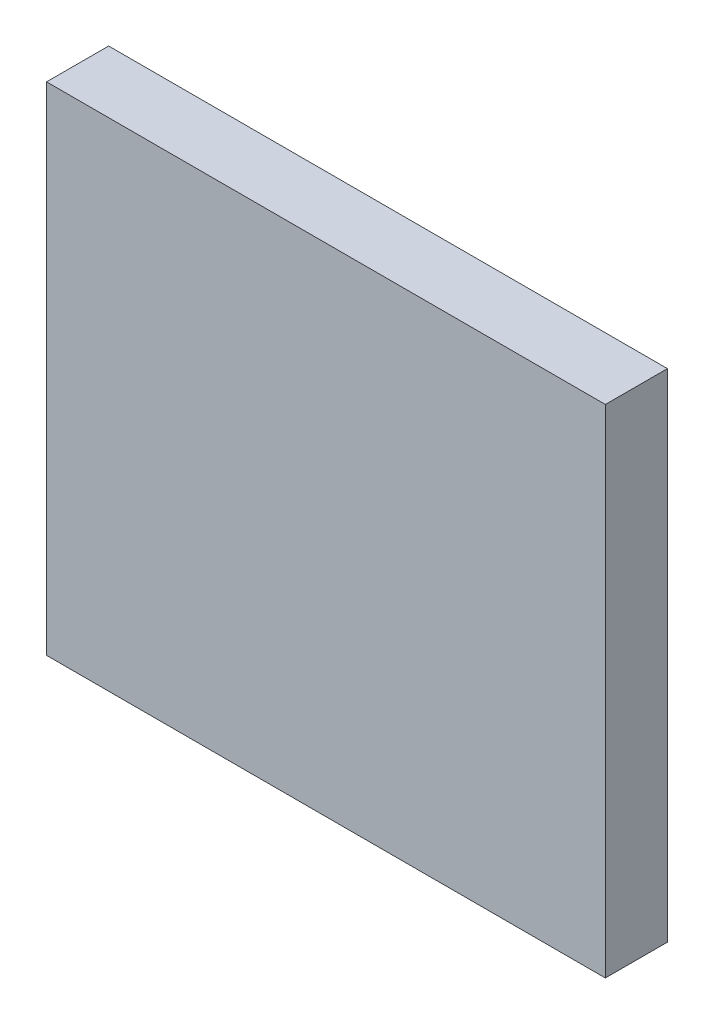
ISO-10303-21;
HEADER;
FILE_DESCRIPTION(('STEP AP214'),'2;1');
FILE_NAME('part.step','',(''),(''),'','','');
FILE_SCHEMA(('AUTOMOTIVE_DESIGN { 1 0 10303 214 1 1 1 1 }'));
ENDSEC;
DATA;
#1=APPLICATION_CONTEXT('core data for automotive mechanical design processes');
#2=APPLICATION_PROTOCOL_DEFINITION('international standard','automotive_design',2000,#1);
#3=PRODUCT_CONTEXT('',#1,'mechanical');
#4=PRODUCT('Part','Part','',(#3));
#5=PRODUCT_RELATED_PRODUCT_CATEGORY('part','',(#4));
#6=PRODUCT_DEFINITION_FORMATION('','',#4);
#7=PRODUCT_DEFINITION_CONTEXT('part definition',#1,'design');
#8=PRODUCT_DEFINITION('design','',#6,#7);
#9=PRODUCT_DEFINITION_SHAPE('','',#8);
#10=(LENGTH_UNIT() NAMED_UNIT(*) SI_UNIT(.MILLI.,.METRE.));
#11=(NAMED_UNIT(*) PLANE_ANGLE_UNIT() SI_UNIT($,.RADIAN.));
#12=(NAMED_UNIT(*) SI_UNIT($,.STERADIAN.) SOLID_ANGLE_UNIT());
#13=UNCERTAINTY_MEASURE_WITH_UNIT(LENGTH_MEASURE(1.E-05),#10,'distance_accuracy_value','');
#14=(GEOMETRIC_REPRESENTATION_CONTEXT(3) GLOBAL_UNCERTAINTY_ASSIGNED_CONTEXT((#13)) GLOBAL_UNIT_ASSIGNED_CONTEXT((#10,
#11,#12)) REPRESENTATION_CONTEXT('',''));
#15=CARTESIAN_POINT('',(0.,0.,0.));
#16=DIRECTION('',(0.,0.,1.));
#17=DIRECTION('',(1.,0.,0.));
#18=AXIS2_PLACEMENT_3D('',#15,#16,#17);
#19=CARTESIAN_POINT('',(135.,-120.,30.));
#20=DIRECTION('',(-1.,0.,0.));
#21=DIRECTION('',(0.,0.,1.));
#22=AXIS2_PLACEMENT_3D('',#19,#20,#21);
#23=PLANE('',#22);
#24=DIRECTION('',(0.,1.,0.));
#25=VECTOR('',#24,1.);
#26=CARTESIAN_POINT('',(135.,-120.,0.));
#27=LINE('',#26,#25);
#28=CARTESIAN_POINT('',(135.,-120.,0.));
#29=VERTEX_POINT('',#28);
#30=CARTESIAN_POINT('',(135.,120.,0.));
#31=VERTEX_POINT('',#30);
#32=EDGE_CURVE('E96',#29,#31,#27,.T.);
#33=ORIENTED_EDGE('',*,*,#32,.T.);
#34=DIRECTION('',(0.,0.,-1.));
#35=VECTOR('',#34,1.);
#36=CARTESIAN_POINT('',(135.,120.,30.));
#37=LINE('',#36,#35);
#38=CARTESIAN_POINT('',(135.,120.,30.));
#39=VERTEX_POINT('',#38);
#40=EDGE_CURVE('E11',#39,#31,#37,.T.);
#41=ORIENTED_EDGE('',*,*,#40,.F.);
#42=DIRECTION('',(0.,1.,0.));
#43=VECTOR('',#42,1.);
#44=CARTESIAN_POINT('',(135.,-120.,30.));
#45=LINE('',#44,#43);
#46=CARTESIAN_POINT('',(135.,-120.,30.));
#47=VERTEX_POINT('',#46);
#48=EDGE_CURVE('E84',#47,#39,#45,.T.);
#49=ORIENTED_EDGE('',*,*,#48,.F.);
#50=DIRECTION('',(0.,0.,-1.));
#51=VECTOR('',#50,1.);
#52=CARTESIAN_POINT('',(135.,-120.,30.));
#53=LINE('',#52,#51);
#54=EDGE_CURVE('E92',#47,#29,#53,.T.);
#55=ORIENTED_EDGE('',*,*,#54,.T.);
#56=EDGE_LOOP('',(#33,#41,#49,#55));
#57=FACE_BOUND('',#56,.T.);
#58=ADVANCED_FACE('F33',(#57),#23,.F.);
#59=CARTESIAN_POINT('',(-135.,120.,30.));
#60=DIRECTION('',(0.,-1.,0.));
#61=DIRECTION('',(0.,0.,-1.));
#62=AXIS2_PLACEMENT_3D('',#59,#60,#61);
#63=PLANE('',#62);
#64=DIRECTION('',(-1.,0.,0.));
#65=VECTOR('',#64,1.);
#66=CARTESIAN_POINT('',(-135.,120.,0.));
#67=LINE('',#66,#65);
#68=CARTESIAN_POINT('',(-135.,120.,0.));
#69=VERTEX_POINT('',#68);
#70=EDGE_CURVE('E88',#31,#69,#67,.T.);
#71=ORIENTED_EDGE('',*,*,#70,.T.);
#72=DIRECTION('',(0.,0.,-1.));
#73=VECTOR('',#72,1.);
#74=CARTESIAN_POINT('',(-135.,120.,30.));
#75=LINE('',#74,#73);
#76=CARTESIAN_POINT('',(-135.,120.,30.));
#77=VERTEX_POINT('',#76);
#78=EDGE_CURVE('E41',#77,#69,#75,.T.);
#79=ORIENTED_EDGE('',*,*,#78,.F.);
#80=DIRECTION('',(-1.,0.,0.));
#81=VECTOR('',#80,1.);
#82=CARTESIAN_POINT('',(-135.,120.,30.));
#83=LINE('',#82,#81);
#84=EDGE_CURVE('E79',#39,#77,#83,.T.);
#85=ORIENTED_EDGE('',*,*,#84,.F.);
#86=ORIENTED_EDGE('',*,*,#40,.T.);
#87=EDGE_LOOP('',(#71,#79,#85,#86));
#88=FACE_BOUND('',#87,.T.);
#89=ADVANCED_FACE('F87',(#88),#63,.F.);
#90=CARTESIAN_POINT('',(-135.,-120.,30.));
#91=DIRECTION('',(1.,0.,0.));
#92=DIRECTION('',(0.,0.,-1.));
#93=AXIS2_PLACEMENT_3D('',#90,#91,#92);
#94=PLANE('',#93);
#95=DIRECTION('',(0.,-1.,0.));
#96=VECTOR('',#95,1.);
#97=CARTESIAN_POINT('',(-135.,-120.,0.));
#98=LINE('',#97,#96);
#99=CARTESIAN_POINT('',(-135.,-120.,0.));
#100=VERTEX_POINT('',#99);
#101=EDGE_CURVE('E66',#69,#100,#98,.T.);
#102=ORIENTED_EDGE('',*,*,#101,.T.);
#103=DIRECTION('',(0.,0.,-1.));
#104=VECTOR('',#103,1.);
#105=CARTESIAN_POINT('',(-135.,-120.,30.));
#106=LINE('',#105,#104);
#107=CARTESIAN_POINT('',(-135.,-120.,30.));
#108=VERTEX_POINT('',#107);
#109=EDGE_CURVE('E89',#108,#100,#106,.T.);
#110=ORIENTED_EDGE('',*,*,#109,.F.);
#111=DIRECTION('',(0.,-1.,0.));
#112=VECTOR('',#111,1.);
#113=CARTESIAN_POINT('',(-135.,-120.,30.));
#114=LINE('',#113,#112);
#115=EDGE_CURVE('E82',#77,#108,#114,.T.);
#116=ORIENTED_EDGE('',*,*,#115,.F.);
#117=ORIENTED_EDGE('',*,*,#78,.T.);
#118=EDGE_LOOP('',(#102,#110,#116,#117));
#119=FACE_BOUND('',#118,.T.);
#120=ADVANCED_FACE('F90',(#119),#94,.F.);
#121=CARTESIAN_POINT('',(-135.,-120.,30.));
#122=DIRECTION('',(0.,1.,0.));
#123=DIRECTION('',(-1.,0.,0.));
#124=AXIS2_PLACEMENT_3D('',#121,#122,#123);
#125=PLANE('',#124);
#126=DIRECTION('',(1.,0.,0.));
#127=VECTOR('',#126,1.);
#128=CARTESIAN_POINT('',(-135.,-120.,0.));
#129=LINE('',#128,#127);
#130=EDGE_CURVE('E72',#100,#29,#129,.T.);
#131=ORIENTED_EDGE('',*,*,#130,.T.);
#132=ORIENTED_EDGE('',*,*,#54,.F.);
#133=DIRECTION('',(1.,0.,0.));
#134=VECTOR('',#133,1.);
#135=CARTESIAN_POINT('',(-135.,-120.,30.));
#136=LINE('',#135,#134);
#137=EDGE_CURVE('E49',#108,#47,#136,.T.);
#138=ORIENTED_EDGE('',*,*,#137,.F.);
#139=ORIENTED_EDGE('',*,*,#109,.T.);
#140=EDGE_LOOP('',(#131,#132,#138,#139));
#141=FACE_BOUND('',#140,.T.);
#142=ADVANCED_FACE('F103',(#141),#125,.F.);
#143=CARTESIAN_POINT('',(0.,0.,30.));
#144=DIRECTION('',(0.,0.,-1.));
#145=DIRECTION('',(-1.,0.,0.));
#146=AXIS2_PLACEMENT_3D('',#143,#144,#145);
#147=PLANE('',#146);
#148=ORIENTED_EDGE('',*,*,#48,.T.);
#149=ORIENTED_EDGE('',*,*,#84,.T.);
#150=ORIENTED_EDGE('',*,*,#115,.T.);
#151=ORIENTED_EDGE('',*,*,#137,.T.);
#152=EDGE_LOOP('',(#148,#149,#150,#151));
#153=FACE_BOUND('',#152,.T.);
#154=ADVANCED_FACE('F80',(#153),#147,.F.);
#155=CARTESIAN_POINT('',(0.,0.,0.));
#156=DIRECTION('',(0.,0.,-1.));
#157=DIRECTION('',(-1.,0.,0.));
#158=AXIS2_PLACEMENT_3D('',#155,#156,#157);
#159=PLANE('',#158);
#160=ORIENTED_EDGE('',*,*,#32,.F.);
#161=ORIENTED_EDGE('',*,*,#130,.F.);
#162=ORIENTED_EDGE('',*,*,#101,.F.);
#163=ORIENTED_EDGE('',*,*,#70,.F.);
#164=EDGE_LOOP('',(#160,#161,#162,#163));
#165=FACE_BOUND('',#164,.T.);
#166=ADVANCED_FACE('F106',(#165),#159,.T.);
#167=CLOSED_SHELL('',(#58,#89,#120,#142,#154,#166));
#168=MANIFOLD_SOLID_BREP('B2',#167);
#169=ADVANCED_BREP_SHAPE_REPRESENTATION('',(#18,#168),#14);
#170=SHAPE_DEFINITION_REPRESENTATION(#9,#169);
ENDSEC;
END-ISO-10303-21;
